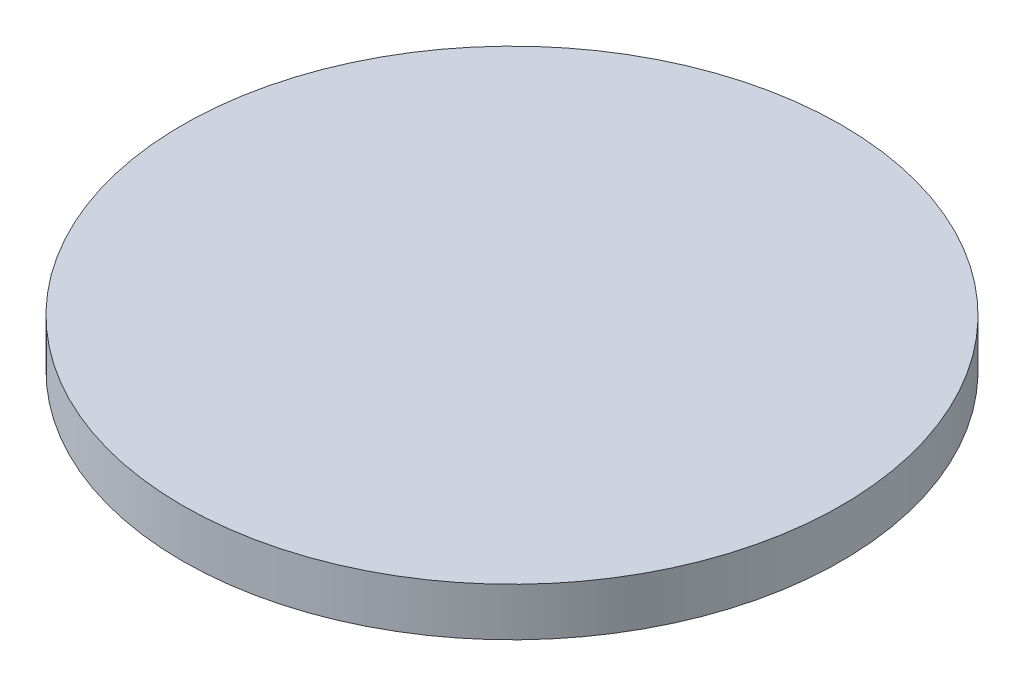
ISO-10303-21;
HEADER;
FILE_DESCRIPTION(('STEP AP214'),'2;1');
FILE_NAME('part.step','',(''),(''),'','','');
FILE_SCHEMA(('AUTOMOTIVE_DESIGN { 1 0 10303 214 1 1 1 1 }'));
ENDSEC;
DATA;
#1=APPLICATION_CONTEXT('core data for automotive mechanical design processes');
#2=APPLICATION_PROTOCOL_DEFINITION('international standard','automotive_design',2000,#1);
#3=PRODUCT_CONTEXT('',#1,'mechanical');
#4=PRODUCT('Part','Part','',(#3));
#5=PRODUCT_RELATED_PRODUCT_CATEGORY('part','',(#4));
#6=PRODUCT_DEFINITION_FORMATION('','',#4);
#7=PRODUCT_DEFINITION_CONTEXT('part definition',#1,'design');
#8=PRODUCT_DEFINITION('design','',#6,#7);
#9=PRODUCT_DEFINITION_SHAPE('','',#8);
#10=(LENGTH_UNIT() NAMED_UNIT(*) SI_UNIT(.MILLI.,.METRE.));
#11=(NAMED_UNIT(*) PLANE_ANGLE_UNIT() SI_UNIT($,.RADIAN.));
#12=(NAMED_UNIT(*) SI_UNIT($,.STERADIAN.) SOLID_ANGLE_UNIT());
#13=UNCERTAINTY_MEASURE_WITH_UNIT(LENGTH_MEASURE(1.E-05),#10,'distance_accuracy_value','');
#14=(GEOMETRIC_REPRESENTATION_CONTEXT(3) GLOBAL_UNCERTAINTY_ASSIGNED_CONTEXT((#13)) GLOBAL_UNIT_ASSIGNED_CONTEXT((#10,
#11,#12)) REPRESENTATION_CONTEXT('',''));
#15=CARTESIAN_POINT('',(0.,0.,0.));
#16=DIRECTION('',(0.,0.,1.));
#17=DIRECTION('',(1.,0.,0.));
#18=AXIS2_PLACEMENT_3D('',#15,#16,#17);
#19=CARTESIAN_POINT('',(0.,3.175,0.));
#20=DIRECTION('',(0.,-1.,0.));
#21=DIRECTION('',(0.,0.,-1.));
#22=AXIS2_PLACEMENT_3D('',#19,#20,#21);
#23=CYLINDRICAL_SURFACE('',#22,21.75);
#24=CARTESIAN_POINT('',(0.,3.175,0.));
#25=DIRECTION('',(0.,1.,0.));
#26=DIRECTION('',(0.,0.,1.));
#27=AXIS2_PLACEMENT_3D('',#24,#25,#26);
#28=CIRCLE('',#27,21.75);
#29=CARTESIAN_POINT('',(0.,3.175,21.75));
#30=VERTEX_POINT('',#29);
#31=EDGE_CURVE('E11',#30,#30,#28,.T.);
#32=ORIENTED_EDGE('',*,*,#31,.F.);
#33=EDGE_LOOP('',(#32));
#34=FACE_BOUND('',#33,.T.);
#35=CARTESIAN_POINT('',(0.,0.,0.));
#36=DIRECTION('',(0.,1.,0.));
#37=DIRECTION('',(0.,0.,1.));
#38=AXIS2_PLACEMENT_3D('',#35,#36,#37);
#39=CIRCLE('',#38,21.75);
#40=CARTESIAN_POINT('',(0.,0.,21.75));
#41=VERTEX_POINT('',#40);
#42=EDGE_CURVE('E41',#41,#41,#39,.T.);
#43=ORIENTED_EDGE('',*,*,#42,.T.);
#44=EDGE_LOOP('',(#43));
#45=FACE_BOUND('',#44,.T.);
#46=ADVANCED_FACE('F38',(#34,#45),#23,.T.);
#47=CARTESIAN_POINT('',(0.,3.175,0.));
#48=DIRECTION('',(0.,1.,0.));
#49=DIRECTION('',(0.,0.,1.));
#50=AXIS2_PLACEMENT_3D('',#47,#48,#49);
#51=PLANE('',#50);
#52=ORIENTED_EDGE('',*,*,#31,.T.);
#53=EDGE_LOOP('',(#52));
#54=FACE_BOUND('',#53,.T.);
#55=ADVANCED_FACE('F75',(#54),#51,.T.);
#56=CARTESIAN_POINT('',(0.,0.,0.));
#57=DIRECTION('',(0.,1.,0.));
#58=DIRECTION('',(0.,0.,1.));
#59=AXIS2_PLACEMENT_3D('',#56,#57,#58);
#60=PLANE('',#59);
#61=CARTESIAN_POINT('',(0.,0.,0.));
#62=DIRECTION('',(0.,1.,0.));
#63=DIRECTION('',(0.,0.,1.));
#64=AXIS2_PLACEMENT_3D('',#61,#62,#63);
#65=CIRCLE('',#64,0.5);
#66=CARTESIAN_POINT('',(0.,0.,0.5));
#67=VERTEX_POINT('',#66);
#68=EDGE_CURVE('E55',#67,#67,#65,.T.);
#69=ORIENTED_EDGE('',*,*,#68,.T.);
#70=EDGE_LOOP('',(#69));
#71=FACE_BOUND('',#70,.T.);
#72=ORIENTED_EDGE('',*,*,#42,.F.);
#73=EDGE_LOOP('',(#72));
#74=FACE_BOUND('',#73,.T.);
#75=ADVANCED_FACE('F72',(#71,#74),#60,.F.);
#76=CARTESIAN_POINT('',(0.,1.,0.));
#77=DIRECTION('',(0.,-1.,0.));
#78=DIRECTION('',(0.,0.,-1.));
#79=AXIS2_PLACEMENT_3D('',#76,#77,#78);
#80=CYLINDRICAL_SURFACE('',#79,0.5);
#81=CARTESIAN_POINT('',(0.,1.,0.));
#82=DIRECTION('',(0.,1.,0.));
#83=DIRECTION('',(0.,0.,1.));
#84=AXIS2_PLACEMENT_3D('',#81,#82,#83);
#85=CIRCLE('',#84,0.5);
#86=CARTESIAN_POINT('',(0.,1.,0.5));
#87=VERTEX_POINT('',#86);
#88=EDGE_CURVE('E52',#87,#87,#85,.T.);
#89=ORIENTED_EDGE('',*,*,#88,.T.);
#90=EDGE_LOOP('',(#89));
#91=FACE_BOUND('',#90,.T.);
#92=ORIENTED_EDGE('',*,*,#68,.F.);
#93=EDGE_LOOP('',(#92));
#94=FACE_BOUND('',#93,.T.);
#95=ADVANCED_FACE('F63',(#91,#94),#80,.F.);
#96=CARTESIAN_POINT('',(0.,1.,0.));
#97=DIRECTION('',(0.,1.,0.));
#98=DIRECTION('',(0.,0.,1.));
#99=AXIS2_PLACEMENT_3D('',#96,#97,#98);
#100=PLANE('',#99);
#101=ORIENTED_EDGE('',*,*,#88,.F.);
#102=EDGE_LOOP('',(#101));
#103=FACE_BOUND('',#102,.T.);
#104=ADVANCED_FACE('F66',(#103),#100,.F.);
#105=CLOSED_SHELL('',(#46,#55,#75,#95,#104));
#106=MANIFOLD_SOLID_BREP('B2',#105);
#107=ADVANCED_BREP_SHAPE_REPRESENTATION('',(#18,#106),#14);
#108=SHAPE_DEFINITION_REPRESENTATION(#9,#107);
ENDSEC;
END-ISO-10303-21;
